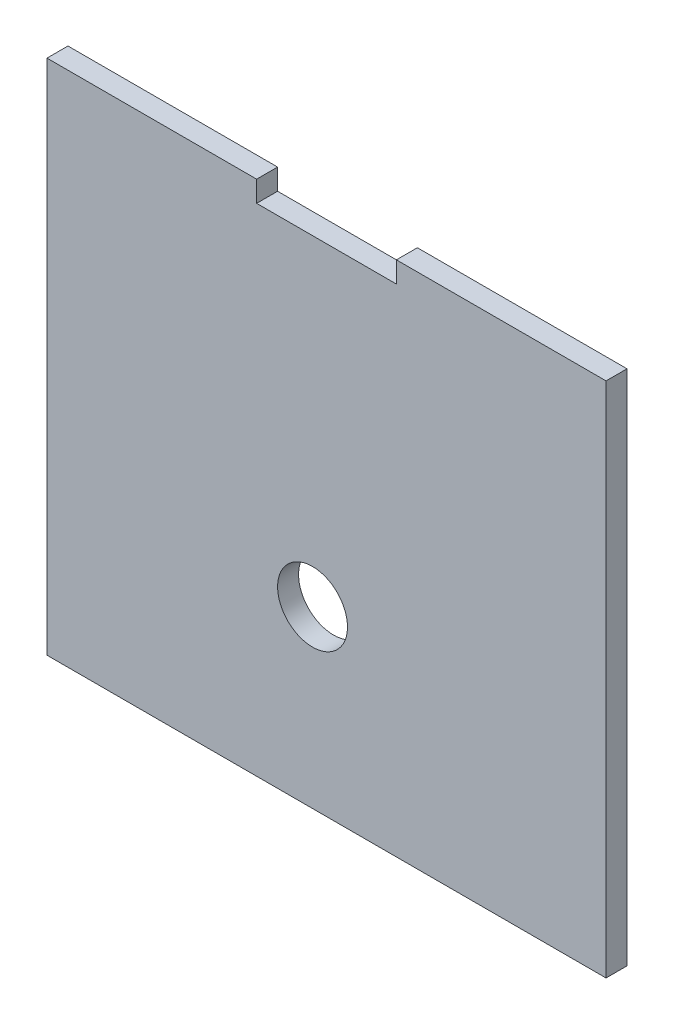
ISO-10303-21;
HEADER;
FILE_DESCRIPTION(('STEP AP214'),'2;1');
FILE_NAME('part.step','',(''),(''),'','','');
FILE_SCHEMA(('AUTOMOTIVE_DESIGN { 1 0 10303 214 1 1 1 1 }'));
ENDSEC;
DATA;
#1=APPLICATION_CONTEXT('core data for automotive mechanical design processes');
#2=APPLICATION_PROTOCOL_DEFINITION('international standard','automotive_design',2000,#1);
#3=PRODUCT_CONTEXT('',#1,'mechanical');
#4=PRODUCT('Part','Part','',(#3));
#5=PRODUCT_RELATED_PRODUCT_CATEGORY('part','',(#4));
#6=PRODUCT_DEFINITION_FORMATION('','',#4);
#7=PRODUCT_DEFINITION_CONTEXT('part definition',#1,'design');
#8=PRODUCT_DEFINITION('design','',#6,#7);
#9=PRODUCT_DEFINITION_SHAPE('','',#8);
#10=(LENGTH_UNIT() NAMED_UNIT(*) SI_UNIT(.MILLI.,.METRE.));
#11=(NAMED_UNIT(*) PLANE_ANGLE_UNIT() SI_UNIT($,.RADIAN.));
#12=(NAMED_UNIT(*) SI_UNIT($,.STERADIAN.) SOLID_ANGLE_UNIT());
#13=UNCERTAINTY_MEASURE_WITH_UNIT(LENGTH_MEASURE(1.E-05),#10,'distance_accuracy_value','');
#14=(GEOMETRIC_REPRESENTATION_CONTEXT(3) GLOBAL_UNCERTAINTY_ASSIGNED_CONTEXT((#13)) GLOBAL_UNIT_ASSIGNED_CONTEXT((#10,
#11,#12)) REPRESENTATION_CONTEXT('',''));
#15=CARTESIAN_POINT('',(0.,0.,0.));
#16=DIRECTION('',(0.,0.,1.));
#17=DIRECTION('',(1.,0.,0.));
#18=AXIS2_PLACEMENT_3D('',#15,#16,#17);
#19=CARTESIAN_POINT('',(0.,51.1529283746728,3.));
#20=DIRECTION('',(0.,-1.,0.));
#21=DIRECTION('',(1.,0.,0.));
#22=AXIS2_PLACEMENT_3D('',#19,#20,#21);
#23=PLANE('',#22);
#24=DIRECTION('',(-1.,0.,0.));
#25=VECTOR('',#24,1.);
#26=CARTESIAN_POINT('',(0.,51.1529283746728,0.));
#27=LINE('',#26,#25);
#28=CARTESIAN_POINT('',(3.,51.1529283746728,0.));
#29=VERTEX_POINT('',#28);
#30=CARTESIAN_POINT('',(-27.,51.1529283746728,0.));
#31=VERTEX_POINT('',#30);
#32=EDGE_CURVE('E147',#29,#31,#27,.T.);
#33=ORIENTED_EDGE('',*,*,#32,.T.);
#34=DIRECTION('',(0.,0.,-1.));
#35=VECTOR('',#34,1.);
#36=CARTESIAN_POINT('',(-27.,51.1529283746728,3.));
#37=LINE('',#36,#35);
#38=CARTESIAN_POINT('',(-27.,51.1529283746728,3.));
#39=VERTEX_POINT('',#38);
#40=EDGE_CURVE('E11',#39,#31,#37,.T.);
#41=ORIENTED_EDGE('',*,*,#40,.F.);
#42=DIRECTION('',(-1.,0.,0.));
#43=VECTOR('',#42,1.);
#44=CARTESIAN_POINT('',(0.,51.1529283746728,3.));
#45=LINE('',#44,#43);
#46=CARTESIAN_POINT('',(3.,51.1529283746728,3.));
#47=VERTEX_POINT('',#46);
#48=EDGE_CURVE('E205',#47,#39,#45,.T.);
#49=ORIENTED_EDGE('',*,*,#48,.F.);
#50=DIRECTION('',(0.,0.,-1.));
#51=VECTOR('',#50,1.);
#52=CARTESIAN_POINT('',(3.,51.1529283746728,3.));
#53=LINE('',#52,#51);
#54=EDGE_CURVE('E57',#47,#29,#53,.T.);
#55=ORIENTED_EDGE('',*,*,#54,.T.);
#56=EDGE_LOOP('',(#33,#41,#49,#55));
#57=FACE_BOUND('',#56,.T.);
#58=ADVANCED_FACE('F39',(#57),#23,.F.);
#59=CARTESIAN_POINT('',(-27.,0.,3.));
#60=DIRECTION('',(1.,0.,0.));
#61=DIRECTION('',(0.,0.,-1.));
#62=AXIS2_PLACEMENT_3D('',#59,#60,#61);
#63=PLANE('',#62);
#64=DIRECTION('',(0.,-1.,0.));
#65=VECTOR('',#64,1.);
#66=CARTESIAN_POINT('',(-27.,0.,0.));
#67=LINE('',#66,#65);
#68=CARTESIAN_POINT('',(-27.,48.1529283746728,0.));
#69=VERTEX_POINT('',#68);
#70=EDGE_CURVE('E150',#31,#69,#67,.T.);
#71=ORIENTED_EDGE('',*,*,#70,.T.);
#72=DIRECTION('',(0.,0.,-1.));
#73=VECTOR('',#72,1.);
#74=CARTESIAN_POINT('',(-27.,48.1529283746728,3.));
#75=LINE('',#74,#73);
#76=CARTESIAN_POINT('',(-27.,48.1529283746728,3.));
#77=VERTEX_POINT('',#76);
#78=EDGE_CURVE('E49',#77,#69,#75,.T.);
#79=ORIENTED_EDGE('',*,*,#78,.F.);
#80=DIRECTION('',(0.,-1.,0.));
#81=VECTOR('',#80,1.);
#82=CARTESIAN_POINT('',(-27.,0.,3.));
#83=LINE('',#82,#81);
#84=EDGE_CURVE('E95',#39,#77,#83,.T.);
#85=ORIENTED_EDGE('',*,*,#84,.F.);
#86=ORIENTED_EDGE('',*,*,#40,.T.);
#87=EDGE_LOOP('',(#71,#79,#85,#86));
#88=FACE_BOUND('',#87,.T.);
#89=ADVANCED_FACE('F191',(#88),#63,.F.);
#90=CARTESIAN_POINT('',(0.,48.1529283746728,3.));
#91=DIRECTION('',(0.,1.,0.));
#92=DIRECTION('',(-1.,0.,0.));
#93=AXIS2_PLACEMENT_3D('',#90,#91,#92);
#94=PLANE('',#93);
#95=DIRECTION('',(1.,0.,0.));
#96=VECTOR('',#95,1.);
#97=CARTESIAN_POINT('',(0.,48.1529283746728,0.));
#98=LINE('',#97,#96);
#99=CARTESIAN_POINT('',(-47.,48.1529283746728,0.));
#100=VERTEX_POINT('',#99);
#101=EDGE_CURVE('E155',#100,#69,#98,.T.);
#102=ORIENTED_EDGE('',*,*,#101,.F.);
#103=DIRECTION('',(0.,0.,-1.));
#104=VECTOR('',#103,1.);
#105=CARTESIAN_POINT('',(-47.,48.1529283746728,3.));
#106=LINE('',#105,#104);
#107=CARTESIAN_POINT('',(-47.,48.1529283746728,3.));
#108=VERTEX_POINT('',#107);
#109=EDGE_CURVE('E182',#108,#100,#106,.T.);
#110=ORIENTED_EDGE('',*,*,#109,.F.);
#111=DIRECTION('',(1.,0.,0.));
#112=VECTOR('',#111,1.);
#113=CARTESIAN_POINT('',(0.,48.1529283746728,3.));
#114=LINE('',#113,#112);
#115=EDGE_CURVE('E190',#108,#77,#114,.T.);
#116=ORIENTED_EDGE('',*,*,#115,.T.);
#117=ORIENTED_EDGE('',*,*,#78,.T.);
#118=EDGE_LOOP('',(#102,#110,#116,#117));
#119=FACE_BOUND('',#118,.T.);
#120=ADVANCED_FACE('F188',(#119),#94,.T.);
#121=CARTESIAN_POINT('',(-47.,0.,3.));
#122=DIRECTION('',(1.,0.,0.));
#123=DIRECTION('',(0.,0.,-1.));
#124=AXIS2_PLACEMENT_3D('',#121,#122,#123);
#125=PLANE('',#124);
#126=DIRECTION('',(0.,-1.,0.));
#127=VECTOR('',#126,1.);
#128=CARTESIAN_POINT('',(-47.,0.,0.));
#129=LINE('',#128,#127);
#130=CARTESIAN_POINT('',(-47.,51.1529283746728,0.));
#131=VERTEX_POINT('',#130);
#132=EDGE_CURVE('E159',#131,#100,#129,.T.);
#133=ORIENTED_EDGE('',*,*,#132,.F.);
#134=DIRECTION('',(0.,0.,-1.));
#135=VECTOR('',#134,1.);
#136=CARTESIAN_POINT('',(-47.,51.1529283746728,3.));
#137=LINE('',#136,#135);
#138=CARTESIAN_POINT('',(-47.,51.1529283746728,3.));
#139=VERTEX_POINT('',#138);
#140=EDGE_CURVE('E179',#139,#131,#137,.T.);
#141=ORIENTED_EDGE('',*,*,#140,.F.);
#142=DIRECTION('',(0.,-1.,0.));
#143=VECTOR('',#142,1.);
#144=CARTESIAN_POINT('',(-47.,0.,3.));
#145=LINE('',#144,#143);
#146=EDGE_CURVE('E200',#139,#108,#145,.T.);
#147=ORIENTED_EDGE('',*,*,#146,.T.);
#148=ORIENTED_EDGE('',*,*,#109,.T.);
#149=EDGE_LOOP('',(#133,#141,#147,#148));
#150=FACE_BOUND('',#149,.T.);
#151=ADVANCED_FACE('F198',(#150),#125,.T.);
#152=CARTESIAN_POINT('',(-77.,51.1529283746728,0.));
#153=VERTEX_POINT('',#152);
#154=EDGE_CURVE('E151',#131,#153,#27,.T.);
#155=ORIENTED_EDGE('',*,*,#154,.T.);
#156=DIRECTION('',(0.,0.,-1.));
#157=VECTOR('',#156,1.);
#158=CARTESIAN_POINT('',(-77.,51.1529283746728,3.));
#159=LINE('',#158,#157);
#160=CARTESIAN_POINT('',(-77.,51.1529283746728,3.));
#161=VERTEX_POINT('',#160);
#162=EDGE_CURVE('E133',#161,#153,#159,.T.);
#163=ORIENTED_EDGE('',*,*,#162,.F.);
#164=EDGE_CURVE('E119',#139,#161,#45,.T.);
#165=ORIENTED_EDGE('',*,*,#164,.F.);
#166=ORIENTED_EDGE('',*,*,#140,.T.);
#167=EDGE_LOOP('',(#155,#163,#165,#166));
#168=FACE_BOUND('',#167,.T.);
#169=ADVANCED_FACE('F228',(#168),#23,.F.);
#170=CARTESIAN_POINT('',(-77.,0.,3.));
#171=DIRECTION('',(1.,0.,0.));
#172=DIRECTION('',(0.,0.,-1.));
#173=AXIS2_PLACEMENT_3D('',#170,#171,#172);
#174=PLANE('',#173);
#175=DIRECTION('',(0.,-1.,0.));
#176=VECTOR('',#175,1.);
#177=CARTESIAN_POINT('',(-77.,0.,0.));
#178=LINE('',#177,#176);
#179=CARTESIAN_POINT('',(-77.,-22.8470716253272,0.));
#180=VERTEX_POINT('',#179);
#181=EDGE_CURVE('E129',#153,#180,#178,.T.);
#182=ORIENTED_EDGE('',*,*,#181,.T.);
#183=DIRECTION('',(0.,0.,-1.));
#184=VECTOR('',#183,1.);
#185=CARTESIAN_POINT('',(-77.,-22.8470716253272,3.));
#186=LINE('',#185,#184);
#187=CARTESIAN_POINT('',(-77.,-22.8470716253272,3.));
#188=VERTEX_POINT('',#187);
#189=EDGE_CURVE('E126',#188,#180,#186,.T.);
#190=ORIENTED_EDGE('',*,*,#189,.F.);
#191=DIRECTION('',(0.,-1.,0.));
#192=VECTOR('',#191,1.);
#193=CARTESIAN_POINT('',(-77.,0.,3.));
#194=LINE('',#193,#192);
#195=EDGE_CURVE('E111',#161,#188,#194,.T.);
#196=ORIENTED_EDGE('',*,*,#195,.F.);
#197=ORIENTED_EDGE('',*,*,#162,.T.);
#198=EDGE_LOOP('',(#182,#190,#196,#197));
#199=FACE_BOUND('',#198,.T.);
#200=ADVANCED_FACE('F127',(#199),#174,.F.);
#201=CARTESIAN_POINT('',(0.,-22.8470716253272,3.));
#202=DIRECTION('',(0.,-1.,0.));
#203=DIRECTION('',(1.,0.,0.));
#204=AXIS2_PLACEMENT_3D('',#201,#202,#203);
#205=PLANE('',#204);
#206=DIRECTION('',(-1.,0.,0.));
#207=VECTOR('',#206,1.);
#208=CARTESIAN_POINT('',(0.,-22.8470716253272,0.));
#209=LINE('',#208,#207);
#210=CARTESIAN_POINT('',(3.00000000000001,-22.8470716253272,0.));
#211=VERTEX_POINT('',#210);
#212=EDGE_CURVE('E165',#211,#180,#209,.T.);
#213=ORIENTED_EDGE('',*,*,#212,.F.);
#214=DIRECTION('',(0.,0.,-1.));
#215=VECTOR('',#214,1.);
#216=CARTESIAN_POINT('',(3.00000000000001,-22.8470716253272,3.));
#217=LINE('',#216,#215);
#218=CARTESIAN_POINT('',(3.00000000000001,-22.8470716253272,3.));
#219=VERTEX_POINT('',#218);
#220=EDGE_CURVE('E83',#219,#211,#217,.T.);
#221=ORIENTED_EDGE('',*,*,#220,.F.);
#222=DIRECTION('',(-1.,0.,0.));
#223=VECTOR('',#222,1.);
#224=CARTESIAN_POINT('',(0.,-22.8470716253272,3.));
#225=LINE('',#224,#223);
#226=EDGE_CURVE('E116',#219,#188,#225,.T.);
#227=ORIENTED_EDGE('',*,*,#226,.T.);
#228=ORIENTED_EDGE('',*,*,#189,.T.);
#229=EDGE_LOOP('',(#213,#221,#227,#228));
#230=FACE_BOUND('',#229,.T.);
#231=ADVANCED_FACE('F135',(#230),#205,.T.);
#232=CARTESIAN_POINT('',(-39.,2.15292837467277,3.));
#233=DIRECTION('',(0.,0.,-1.));
#234=DIRECTION('',(-1.,0.,0.));
#235=AXIS2_PLACEMENT_3D('',#232,#233,#234);
#236=CYLINDRICAL_SURFACE('',#235,5.);
#237=CARTESIAN_POINT('',(-39.,2.15292837467277,3.));
#238=DIRECTION('',(0.,0.,1.));
#239=DIRECTION('',(1.,0.,0.));
#240=AXIS2_PLACEMENT_3D('',#237,#238,#239);
#241=CIRCLE('',#240,5.);
#242=CARTESIAN_POINT('',(-34.,2.15292837467277,3.));
#243=VERTEX_POINT('',#242);
#244=EDGE_CURVE('E172',#243,#243,#241,.T.);
#245=ORIENTED_EDGE('',*,*,#244,.T.);
#246=EDGE_LOOP('',(#245));
#247=FACE_BOUND('',#246,.T.);
#248=CARTESIAN_POINT('',(-39.,2.15292837467277,0.));
#249=DIRECTION('',(0.,0.,1.));
#250=DIRECTION('',(1.,0.,0.));
#251=AXIS2_PLACEMENT_3D('',#248,#249,#250);
#252=CIRCLE('',#251,5.);
#253=CARTESIAN_POINT('',(-34.,2.15292837467277,0.));
#254=VERTEX_POINT('',#253);
#255=EDGE_CURVE('E143',#254,#254,#252,.T.);
#256=ORIENTED_EDGE('',*,*,#255,.F.);
#257=EDGE_LOOP('',(#256));
#258=FACE_BOUND('',#257,.T.);
#259=ADVANCED_FACE('F41',(#247,#258),#236,.F.);
#260=CARTESIAN_POINT('',(3.00000000000001,0.,3.));
#261=DIRECTION('',(1.,0.,0.));
#262=DIRECTION('',(0.,1.,0.));
#263=AXIS2_PLACEMENT_3D('',#260,#261,#262);
#264=PLANE('',#263);
#265=DIRECTION('',(0.,-1.,0.));
#266=VECTOR('',#265,1.);
#267=CARTESIAN_POINT('',(3.00000000000001,0.,0.));
#268=LINE('',#267,#266);
#269=EDGE_CURVE('E168',#29,#211,#268,.T.);
#270=ORIENTED_EDGE('',*,*,#269,.F.);
#271=ORIENTED_EDGE('',*,*,#54,.F.);
#272=DIRECTION('',(0.,-1.,0.));
#273=VECTOR('',#272,1.);
#274=CARTESIAN_POINT('',(3.00000000000001,0.,3.));
#275=LINE('',#274,#273);
#276=EDGE_CURVE('E137',#47,#219,#275,.T.);
#277=ORIENTED_EDGE('',*,*,#276,.T.);
#278=ORIENTED_EDGE('',*,*,#220,.T.);
#279=EDGE_LOOP('',(#270,#271,#277,#278));
#280=FACE_BOUND('',#279,.T.);
#281=ADVANCED_FACE('F217',(#280),#264,.T.);
#282=CARTESIAN_POINT('',(0.,0.,3.));
#283=DIRECTION('',(0.,0.,1.));
#284=DIRECTION('',(1.,0.,0.));
#285=AXIS2_PLACEMENT_3D('',#282,#283,#284);
#286=PLANE('',#285);
#287=ORIENTED_EDGE('',*,*,#244,.F.);
#288=EDGE_LOOP('',(#287));
#289=FACE_BOUND('',#288,.T.);
#290=ORIENTED_EDGE('',*,*,#48,.T.);
#291=ORIENTED_EDGE('',*,*,#84,.T.);
#292=ORIENTED_EDGE('',*,*,#115,.F.);
#293=ORIENTED_EDGE('',*,*,#146,.F.);
#294=ORIENTED_EDGE('',*,*,#164,.T.);
#295=ORIENTED_EDGE('',*,*,#195,.T.);
#296=ORIENTED_EDGE('',*,*,#226,.F.);
#297=ORIENTED_EDGE('',*,*,#276,.F.);
#298=EDGE_LOOP('',(#290,#291,#292,#293,#294,#295,#296,#297));
#299=FACE_BOUND('',#298,.T.);
#300=ADVANCED_FACE('F113',(#289,#299),#286,.T.);
#301=CARTESIAN_POINT('',(0.,0.,0.));
#302=DIRECTION('',(0.,0.,1.));
#303=DIRECTION('',(1.,0.,0.));
#304=AXIS2_PLACEMENT_3D('',#301,#302,#303);
#305=PLANE('',#304);
#306=ORIENTED_EDGE('',*,*,#255,.T.);
#307=EDGE_LOOP('',(#306));
#308=FACE_BOUND('',#307,.T.);
#309=ORIENTED_EDGE('',*,*,#32,.F.);
#310=ORIENTED_EDGE('',*,*,#269,.T.);
#311=ORIENTED_EDGE('',*,*,#212,.T.);
#312=ORIENTED_EDGE('',*,*,#181,.F.);
#313=ORIENTED_EDGE('',*,*,#154,.F.);
#314=ORIENTED_EDGE('',*,*,#132,.T.);
#315=ORIENTED_EDGE('',*,*,#101,.T.);
#316=ORIENTED_EDGE('',*,*,#70,.F.);
#317=EDGE_LOOP('',(#309,#310,#311,#312,#313,#314,#315,#316));
#318=FACE_BOUND('',#317,.T.);
#319=ADVANCED_FACE('F194',(#308,#318),#305,.F.);
#320=CLOSED_SHELL('',(#58,#89,#120,#151,#169,#200,#231,#259,#281,#300,#319));
#321=MANIFOLD_SOLID_BREP('B2',#320);
#322=ADVANCED_BREP_SHAPE_REPRESENTATION('',(#18,#321),#14);
#323=SHAPE_DEFINITION_REPRESENTATION(#9,#322);
ENDSEC;
END-ISO-10303-21;
